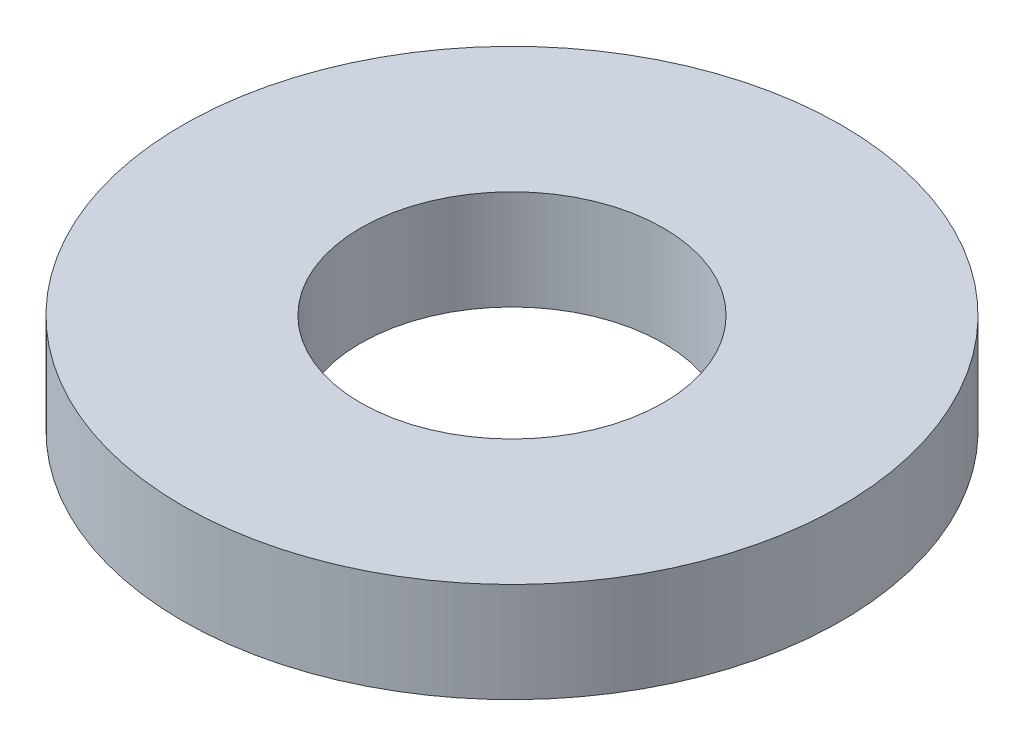
ISO-10303-21;
HEADER;
FILE_DESCRIPTION(('STEP AP214'),'2;1');
FILE_NAME('part.step','',(''),(''),'','','');
FILE_SCHEMA(('AUTOMOTIVE_DESIGN { 1 0 10303 214 1 1 1 1 }'));
ENDSEC;
DATA;
#1=APPLICATION_CONTEXT('core data for automotive mechanical design processes');
#2=APPLICATION_PROTOCOL_DEFINITION('international standard','automotive_design',2000,#1);
#3=PRODUCT_CONTEXT('',#1,'mechanical');
#4=PRODUCT('Part','Part','',(#3));
#5=PRODUCT_RELATED_PRODUCT_CATEGORY('part','',(#4));
#6=PRODUCT_DEFINITION_FORMATION('','',#4);
#7=PRODUCT_DEFINITION_CONTEXT('part definition',#1,'design');
#8=PRODUCT_DEFINITION('design','',#6,#7);
#9=PRODUCT_DEFINITION_SHAPE('','',#8);
#10=(LENGTH_UNIT() NAMED_UNIT(*) SI_UNIT(.MILLI.,.METRE.));
#11=(NAMED_UNIT(*) PLANE_ANGLE_UNIT() SI_UNIT($,.RADIAN.));
#12=(NAMED_UNIT(*) SI_UNIT($,.STERADIAN.) SOLID_ANGLE_UNIT());
#13=UNCERTAINTY_MEASURE_WITH_UNIT(LENGTH_MEASURE(1.E-05),#10,'distance_accuracy_value','');
#14=(GEOMETRIC_REPRESENTATION_CONTEXT(3) GLOBAL_UNCERTAINTY_ASSIGNED_CONTEXT((#13)) GLOBAL_UNIT_ASSIGNED_CONTEXT((#10,
#11,#12)) REPRESENTATION_CONTEXT('',''));
#15=CARTESIAN_POINT('',(0.,0.,0.));
#16=DIRECTION('',(0.,0.,1.));
#17=DIRECTION('',(1.,0.,0.));
#18=AXIS2_PLACEMENT_3D('',#15,#16,#17);
#19=CARTESIAN_POINT('',(0.,28.,0.));
#20=DIRECTION('',(0.,-1.,0.));
#21=DIRECTION('',(0.,0.,-1.));
#22=AXIS2_PLACEMENT_3D('',#19,#20,#21);
#23=CYLINDRICAL_SURFACE('',#22,92.5);
#24=CARTESIAN_POINT('',(0.,28.,0.));
#25=DIRECTION('',(0.,1.,0.));
#26=DIRECTION('',(0.,0.,1.));
#27=AXIS2_PLACEMENT_3D('',#24,#25,#26);
#28=CIRCLE('',#27,92.5);
#29=CARTESIAN_POINT('',(0.,28.,92.5));
#30=VERTEX_POINT('',#29);
#31=EDGE_CURVE('E10',#30,#30,#28,.T.);
#32=ORIENTED_EDGE('',*,*,#31,.F.);
#33=EDGE_LOOP('',(#32));
#34=FACE_BOUND('',#33,.T.);
#35=CARTESIAN_POINT('',(0.,0.,0.));
#36=DIRECTION('',(0.,1.,0.));
#37=DIRECTION('',(0.,0.,1.));
#38=AXIS2_PLACEMENT_3D('',#35,#36,#37);
#39=CIRCLE('',#38,92.5);
#40=CARTESIAN_POINT('',(0.,0.,92.5));
#41=VERTEX_POINT('',#40);
#42=EDGE_CURVE('E37',#41,#41,#39,.T.);
#43=ORIENTED_EDGE('',*,*,#42,.T.);
#44=EDGE_LOOP('',(#43));
#45=FACE_BOUND('',#44,.T.);
#46=ADVANCED_FACE('F40',(#34,#45),#23,.T.);
#47=CARTESIAN_POINT('',(0.,28.,0.));
#48=DIRECTION('',(0.,1.,0.));
#49=DIRECTION('',(0.,0.,1.));
#50=AXIS2_PLACEMENT_3D('',#47,#48,#49);
#51=PLANE('',#50);
#52=CARTESIAN_POINT('',(0.,28.,0.));
#53=DIRECTION('',(0.,1.,0.));
#54=DIRECTION('',(0.,0.,1.));
#55=AXIS2_PLACEMENT_3D('',#52,#53,#54);
#56=CIRCLE('',#55,42.5);
#57=CARTESIAN_POINT('',(0.,28.,42.5));
#58=VERTEX_POINT('',#57);
#59=EDGE_CURVE('E50',#58,#58,#56,.T.);
#60=ORIENTED_EDGE('',*,*,#59,.F.);
#61=EDGE_LOOP('',(#60));
#62=FACE_BOUND('',#61,.T.);
#63=ORIENTED_EDGE('',*,*,#31,.T.);
#64=EDGE_LOOP('',(#63));
#65=FACE_BOUND('',#64,.T.);
#66=ADVANCED_FACE('F59',(#62,#65),#51,.T.);
#67=CARTESIAN_POINT('',(0.,0.,0.));
#68=DIRECTION('',(0.,1.,0.));
#69=DIRECTION('',(0.,0.,1.));
#70=AXIS2_PLACEMENT_3D('',#67,#68,#69);
#71=PLANE('',#70);
#72=CARTESIAN_POINT('',(0.,0.,0.));
#73=DIRECTION('',(0.,1.,0.));
#74=DIRECTION('',(0.,0.,1.));
#75=AXIS2_PLACEMENT_3D('',#72,#73,#74);
#76=CIRCLE('',#75,42.5);
#77=CARTESIAN_POINT('',(0.,0.,42.5));
#78=VERTEX_POINT('',#77);
#79=EDGE_CURVE('E47',#78,#78,#76,.T.);
#80=ORIENTED_EDGE('',*,*,#79,.T.);
#81=EDGE_LOOP('',(#80));
#82=FACE_BOUND('',#81,.T.);
#83=ORIENTED_EDGE('',*,*,#42,.F.);
#84=EDGE_LOOP('',(#83));
#85=FACE_BOUND('',#84,.T.);
#86=ADVANCED_FACE('F58',(#82,#85),#71,.F.);
#87=CARTESIAN_POINT('',(0.,28.,0.));
#88=DIRECTION('',(0.,-1.,0.));
#89=DIRECTION('',(0.,0.,-1.));
#90=AXIS2_PLACEMENT_3D('',#87,#88,#89);
#91=CYLINDRICAL_SURFACE('',#90,42.5);
#92=ORIENTED_EDGE('',*,*,#59,.T.);
#93=EDGE_LOOP('',(#92));
#94=FACE_BOUND('',#93,.T.);
#95=ORIENTED_EDGE('',*,*,#79,.F.);
#96=EDGE_LOOP('',(#95));
#97=FACE_BOUND('',#96,.T.);
#98=ADVANCED_FACE('F54',(#94,#97),#91,.F.);
#99=CLOSED_SHELL('',(#46,#66,#86,#98));
#100=MANIFOLD_SOLID_BREP('B2',#99);
#101=ADVANCED_BREP_SHAPE_REPRESENTATION('',(#18,#100),#14);
#102=SHAPE_DEFINITION_REPRESENTATION(#9,#101);
ENDSEC;
END-ISO-10303-21;
